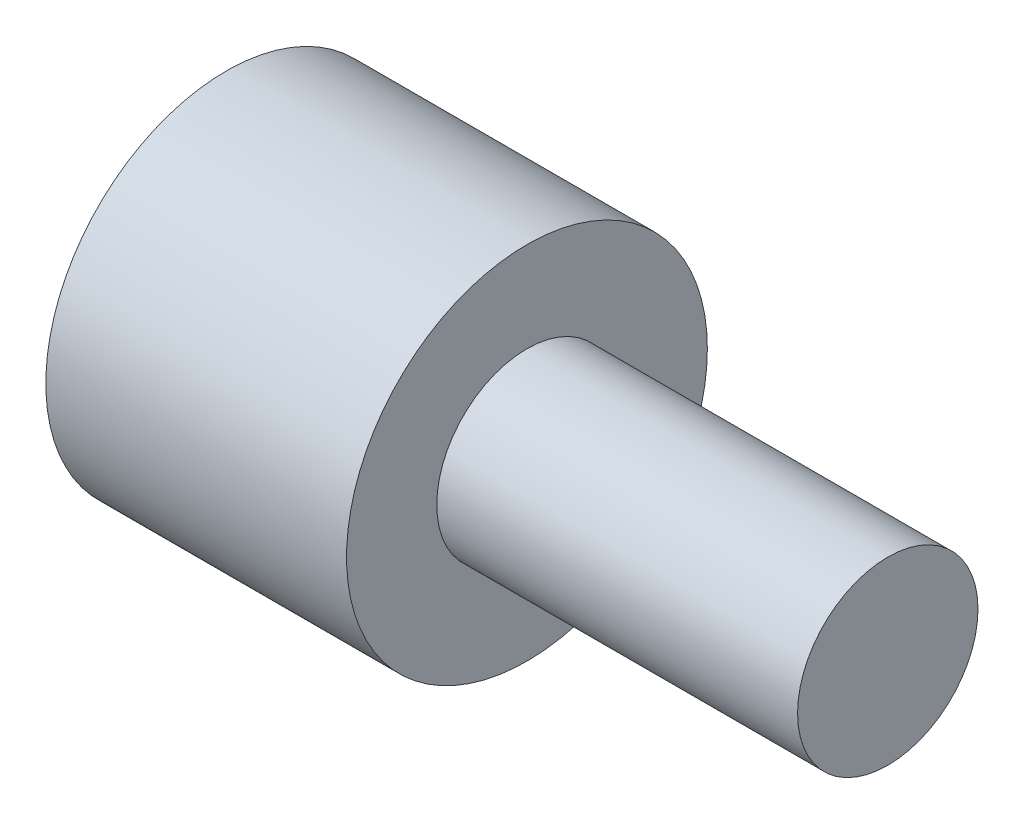
ISO-10303-21;
HEADER;
FILE_DESCRIPTION(('STEP AP214'),'2;1');
FILE_NAME('part.step','',(''),(''),'','','');
FILE_SCHEMA(('AUTOMOTIVE_DESIGN { 1 0 10303 214 1 1 1 1 }'));
ENDSEC;
DATA;
#1=APPLICATION_CONTEXT('core data for automotive mechanical design processes');
#2=APPLICATION_PROTOCOL_DEFINITION('international standard','automotive_design',2000,#1);
#3=PRODUCT_CONTEXT('',#1,'mechanical');
#4=PRODUCT('Part','Part','',(#3));
#5=PRODUCT_RELATED_PRODUCT_CATEGORY('part','',(#4));
#6=PRODUCT_DEFINITION_FORMATION('','',#4);
#7=PRODUCT_DEFINITION_CONTEXT('part definition',#1,'design');
#8=PRODUCT_DEFINITION('design','',#6,#7);
#9=PRODUCT_DEFINITION_SHAPE('','',#8);
#10=(LENGTH_UNIT() NAMED_UNIT(*) SI_UNIT(.MILLI.,.METRE.));
#11=(NAMED_UNIT(*) PLANE_ANGLE_UNIT() SI_UNIT($,.RADIAN.));
#12=(NAMED_UNIT(*) SI_UNIT($,.STERADIAN.) SOLID_ANGLE_UNIT());
#13=UNCERTAINTY_MEASURE_WITH_UNIT(LENGTH_MEASURE(1.E-05),#10,'distance_accuracy_value','');
#14=(GEOMETRIC_REPRESENTATION_CONTEXT(3) GLOBAL_UNCERTAINTY_ASSIGNED_CONTEXT((#13)) GLOBAL_UNIT_ASSIGNED_CONTEXT((#10,
#11,#12)) REPRESENTATION_CONTEXT('',''));
#15=CARTESIAN_POINT('',(0.,0.,0.));
#16=DIRECTION('',(0.,0.,1.));
#17=DIRECTION('',(1.,0.,0.));
#18=AXIS2_PLACEMENT_3D('',#15,#16,#17);
#19=CARTESIAN_POINT('',(0.,0.,0.));
#20=DIRECTION('',(-1.,0.,0.));
#21=DIRECTION('',(0.,0.,1.));
#22=AXIS2_PLACEMENT_3D('',#19,#20,#21);
#23=PLANE('',#22);
#24=CARTESIAN_POINT('',(0.,0.,0.));
#25=DIRECTION('',(-1.,0.,0.));
#26=DIRECTION('',(0.,0.,1.));
#27=AXIS2_PLACEMENT_3D('',#24,#25,#26);
#28=CIRCLE('',#27,1.25);
#29=CARTESIAN_POINT('',(0.,0.,1.25));
#30=VERTEX_POINT('',#29);
#31=EDGE_CURVE('E57',#30,#30,#28,.T.);
#32=ORIENTED_EDGE('',*,*,#31,.F.);
#33=EDGE_LOOP('',(#32));
#34=FACE_BOUND('',#33,.T.);
#35=CARTESIAN_POINT('',(0.,0.,0.));
#36=DIRECTION('',(1.,0.,0.));
#37=DIRECTION('',(0.,0.,-1.));
#38=AXIS2_PLACEMENT_3D('',#35,#36,#37);
#39=CIRCLE('',#38,3.);
#40=CARTESIAN_POINT('',(0.,0.,-3.));
#41=VERTEX_POINT('',#40);
#42=EDGE_CURVE('E11',#41,#41,#39,.T.);
#43=ORIENTED_EDGE('',*,*,#42,.F.);
#44=EDGE_LOOP('',(#43));
#45=FACE_BOUND('',#44,.T.);
#46=ADVANCED_FACE('F37',(#34,#45),#23,.T.);
#47=CARTESIAN_POINT('',(11.,0.,0.));
#48=DIRECTION('',(1.,0.,0.));
#49=DIRECTION('',(0.,0.,-1.));
#50=AXIS2_PLACEMENT_3D('',#47,#48,#49);
#51=CYLINDRICAL_SURFACE('',#50,3.);
#52=ORIENTED_EDGE('',*,*,#42,.T.);
#53=EDGE_LOOP('',(#52));
#54=FACE_BOUND('',#53,.T.);
#55=CARTESIAN_POINT('',(5.,0.,0.));
#56=DIRECTION('',(1.,0.,0.));
#57=DIRECTION('',(0.,0.,-1.));
#58=AXIS2_PLACEMENT_3D('',#55,#56,#57);
#59=CIRCLE('',#58,3.);
#60=CARTESIAN_POINT('',(5.,0.,-3.));
#61=VERTEX_POINT('',#60);
#62=EDGE_CURVE('E43',#61,#61,#59,.T.);
#63=ORIENTED_EDGE('',*,*,#62,.F.);
#64=EDGE_LOOP('',(#63));
#65=FACE_BOUND('',#64,.T.);
#66=ADVANCED_FACE('F72',(#54,#65),#51,.T.);
#67=CARTESIAN_POINT('',(5.,3.,0.));
#68=DIRECTION('',(1.,0.,0.));
#69=DIRECTION('',(0.,0.,-1.));
#70=AXIS2_PLACEMENT_3D('',#67,#68,#69);
#71=PLANE('',#70);
#72=ORIENTED_EDGE('',*,*,#62,.T.);
#73=EDGE_LOOP('',(#72));
#74=FACE_BOUND('',#73,.T.);
#75=CARTESIAN_POINT('',(5.,0.,0.));
#76=DIRECTION('',(1.,0.,0.));
#77=DIRECTION('',(0.,0.,-1.));
#78=AXIS2_PLACEMENT_3D('',#75,#76,#77);
#79=CIRCLE('',#78,1.5);
#80=CARTESIAN_POINT('',(5.,0.,-1.5));
#81=VERTEX_POINT('',#80);
#82=EDGE_CURVE('E60',#81,#81,#79,.T.);
#83=ORIENTED_EDGE('',*,*,#82,.F.);
#84=EDGE_LOOP('',(#83));
#85=FACE_BOUND('',#84,.T.);
#86=ADVANCED_FACE('F69',(#74,#85),#71,.T.);
#87=CARTESIAN_POINT('',(11.,0.,0.));
#88=DIRECTION('',(1.,0.,0.));
#89=DIRECTION('',(0.,0.,-1.));
#90=AXIS2_PLACEMENT_3D('',#87,#88,#89);
#91=CYLINDRICAL_SURFACE('',#90,1.5);
#92=ORIENTED_EDGE('',*,*,#82,.T.);
#93=EDGE_LOOP('',(#92));
#94=FACE_BOUND('',#93,.T.);
#95=CARTESIAN_POINT('',(11.,0.,0.));
#96=DIRECTION('',(1.,0.,0.));
#97=DIRECTION('',(0.,0.,-1.));
#98=AXIS2_PLACEMENT_3D('',#95,#96,#97);
#99=CIRCLE('',#98,1.5);
#100=CARTESIAN_POINT('',(11.,0.,-1.5));
#101=VERTEX_POINT('',#100);
#102=EDGE_CURVE('E56',#101,#101,#99,.T.);
#103=ORIENTED_EDGE('',*,*,#102,.F.);
#104=EDGE_LOOP('',(#103));
#105=FACE_BOUND('',#104,.T.);
#106=ADVANCED_FACE('F79',(#94,#105),#91,.T.);
#107=CARTESIAN_POINT('',(11.,1.5,0.));
#108=DIRECTION('',(1.,0.,0.));
#109=DIRECTION('',(0.,0.,-1.));
#110=AXIS2_PLACEMENT_3D('',#107,#108,#109);
#111=PLANE('',#110);
#112=ORIENTED_EDGE('',*,*,#102,.T.);
#113=EDGE_LOOP('',(#112));
#114=FACE_BOUND('',#113,.T.);
#115=ADVANCED_FACE('F50',(#114),#111,.T.);
#116=CARTESIAN_POINT('',(5.,0.,0.));
#117=DIRECTION('',(-1.,0.,0.));
#118=DIRECTION('',(0.,0.,1.));
#119=AXIS2_PLACEMENT_3D('',#116,#117,#118);
#120=CONICAL_SURFACE('',#119,1.25,1.02974425867665);
#121=CARTESIAN_POINT('',(5.75107577378445,0.,0.));
#122=VERTEX_POINT('',#121);
#123=VERTEX_LOOP('',#122);
#124=FACE_BOUND('',#123,.T.);
#125=CARTESIAN_POINT('',(5.,0.,0.));
#126=DIRECTION('',(-1.,0.,0.));
#127=DIRECTION('',(0.,0.,1.));
#128=AXIS2_PLACEMENT_3D('',#125,#126,#127);
#129=CIRCLE('',#128,1.25);
#130=CARTESIAN_POINT('',(5.,0.,1.25));
#131=VERTEX_POINT('',#130);
#132=EDGE_CURVE('E54',#131,#131,#129,.T.);
#133=ORIENTED_EDGE('',*,*,#132,.T.);
#134=EDGE_LOOP('',(#133));
#135=FACE_BOUND('',#134,.T.);
#136=ADVANCED_FACE('F46',(#124,#135),#120,.F.);
#137=CARTESIAN_POINT('',(0.,0.,0.));
#138=DIRECTION('',(-1.,0.,0.));
#139=DIRECTION('',(0.,0.,1.));
#140=AXIS2_PLACEMENT_3D('',#137,#138,#139);
#141=CYLINDRICAL_SURFACE('',#140,1.25);
#142=ORIENTED_EDGE('',*,*,#132,.F.);
#143=EDGE_LOOP('',(#142));
#144=FACE_BOUND('',#143,.T.);
#145=ORIENTED_EDGE('',*,*,#31,.T.);
#146=EDGE_LOOP('',(#145));
#147=FACE_BOUND('',#146,.T.);
#148=ADVANCED_FACE('F49',(#144,#147),#141,.F.);
#149=CLOSED_SHELL('',(#46,#66,#86,#106,#115,#136,#148));
#150=MANIFOLD_SOLID_BREP('B2',#149);
#151=ADVANCED_BREP_SHAPE_REPRESENTATION('',(#18,#150),#14);
#152=SHAPE_DEFINITION_REPRESENTATION(#9,#151);
ENDSEC;
END-ISO-10303-21;
